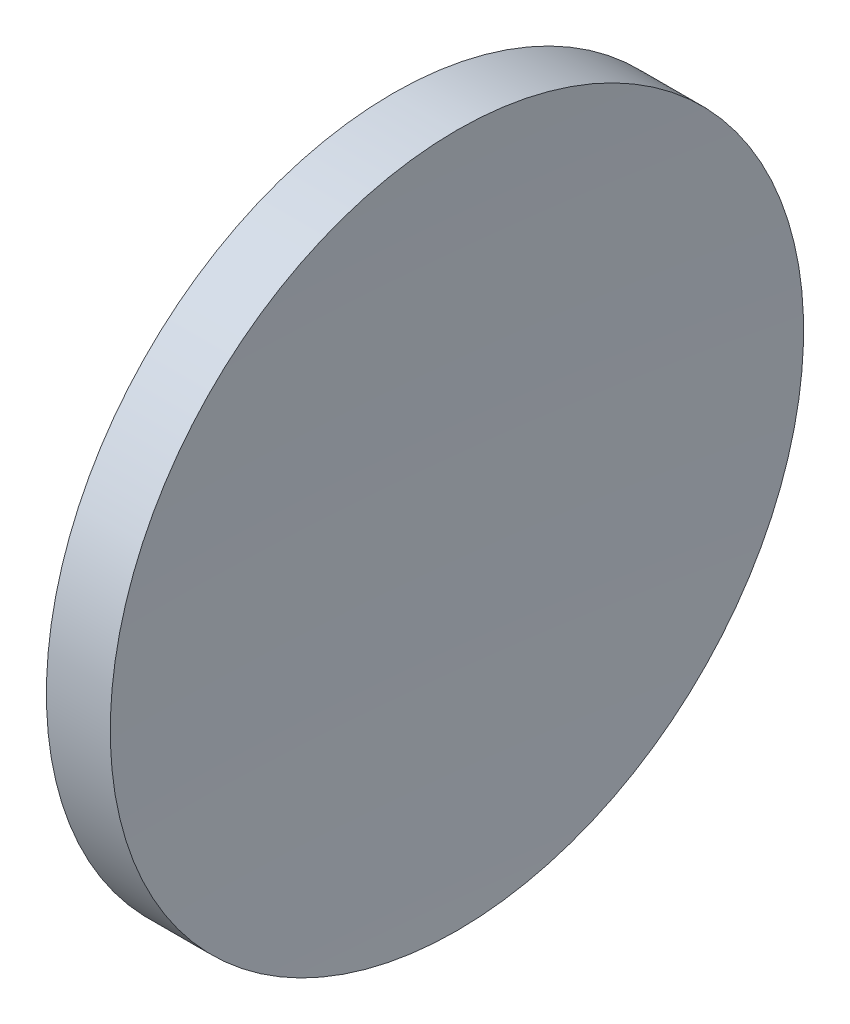
ISO-10303-21;
HEADER;
FILE_DESCRIPTION(('STEP AP214'),'2;1');
FILE_NAME('part.step','',(''),(''),'','','');
FILE_SCHEMA(('AUTOMOTIVE_DESIGN { 1 0 10303 214 1 1 1 1 }'));
ENDSEC;
DATA;
#1=APPLICATION_CONTEXT('core data for automotive mechanical design processes');
#2=APPLICATION_PROTOCOL_DEFINITION('international standard','automotive_design',2000,#1);
#3=PRODUCT_CONTEXT('',#1,'mechanical');
#4=PRODUCT('Part','Part','',(#3));
#5=PRODUCT_RELATED_PRODUCT_CATEGORY('part','',(#4));
#6=PRODUCT_DEFINITION_FORMATION('','',#4);
#7=PRODUCT_DEFINITION_CONTEXT('part definition',#1,'design');
#8=PRODUCT_DEFINITION('design','',#6,#7);
#9=PRODUCT_DEFINITION_SHAPE('','',#8);
#10=(LENGTH_UNIT() NAMED_UNIT(*) SI_UNIT(.MILLI.,.METRE.));
#11=(NAMED_UNIT(*) PLANE_ANGLE_UNIT() SI_UNIT($,.RADIAN.));
#12=(NAMED_UNIT(*) SI_UNIT($,.STERADIAN.) SOLID_ANGLE_UNIT());
#13=UNCERTAINTY_MEASURE_WITH_UNIT(LENGTH_MEASURE(1.E-05),#10,'distance_accuracy_value','');
#14=(GEOMETRIC_REPRESENTATION_CONTEXT(3) GLOBAL_UNCERTAINTY_ASSIGNED_CONTEXT((#13)) GLOBAL_UNIT_ASSIGNED_CONTEXT((#10,
#11,#12)) REPRESENTATION_CONTEXT('',''));
#15=CARTESIAN_POINT('',(0.,0.,0.));
#16=DIRECTION('',(0.,0.,1.));
#17=DIRECTION('',(1.,0.,0.));
#18=AXIS2_PLACEMENT_3D('',#15,#16,#17);
#19=CARTESIAN_POINT('',(317.538190158021,32.5787259132932,0.));
#20=DIRECTION('',(-1.,0.,0.));
#21=DIRECTION('',(0.,-1.,0.));
#22=AXIS2_PLACEMENT_3D('',#19,#20,#21);
#23=SPHERICAL_SURFACE('',#22,258.18);
#24=CARTESIAN_POINT('',(59.6609666581548,32.5787259132931,0.));
#25=DIRECTION('',(-1.,0.,0.));
#26=DIRECTION('',(0.,-1.,0.));
#27=AXIS2_PLACEMENT_3D('',#24,#25,#26);
#28=CIRCLE('',#27,12.5);
#29=CARTESIAN_POINT('',(59.6609666581548,20.0787259132931,0.));
#30=VERTEX_POINT('',#29);
#31=EDGE_CURVE('E10',#30,#30,#28,.T.);
#32=ORIENTED_EDGE('',*,*,#31,.F.);
#33=EDGE_LOOP('',(#32));
#34=FACE_BOUND('',#33,.T.);
#35=ADVANCED_FACE('F35',(#34),#23,.F.);
#36=CARTESIAN_POINT('',(55.0073946244212,32.5787259132931,0.));
#37=DIRECTION('',(-1.,0.,0.));
#38=DIRECTION('',(0.,-1.,0.));
#39=AXIS2_PLACEMENT_3D('',#36,#37,#38);
#40=CYLINDRICAL_SURFACE('',#39,12.5);
#41=CARTESIAN_POINT('',(57.3581901580211,32.5787259132931,0.));
#42=DIRECTION('',(-1.,0.,0.));
#43=DIRECTION('',(0.,-1.,0.));
#44=AXIS2_PLACEMENT_3D('',#41,#42,#43);
#45=CIRCLE('',#44,12.5);
#46=CARTESIAN_POINT('',(57.3581901580211,20.0787259132931,0.));
#47=VERTEX_POINT('',#46);
#48=EDGE_CURVE('E41',#47,#47,#45,.T.);
#49=ORIENTED_EDGE('',*,*,#48,.F.);
#50=EDGE_LOOP('',(#49));
#51=FACE_BOUND('',#50,.T.);
#52=ORIENTED_EDGE('',*,*,#31,.T.);
#53=EDGE_LOOP('',(#52));
#54=FACE_BOUND('',#53,.T.);
#55=ADVANCED_FACE('F49',(#51,#54),#40,.T.);
#56=CARTESIAN_POINT('',(57.3581901580211,32.5787259132931,0.));
#57=DIRECTION('',(1.,0.,0.));
#58=DIRECTION('',(0.,1.,0.));
#59=AXIS2_PLACEMENT_3D('',#56,#57,#58);
#60=PLANE('',#59);
#61=ORIENTED_EDGE('',*,*,#48,.T.);
#62=EDGE_LOOP('',(#61));
#63=FACE_BOUND('',#62,.T.);
#64=ADVANCED_FACE('F47',(#63),#60,.F.);
#65=CLOSED_SHELL('',(#35,#55,#64));
#66=MANIFOLD_SOLID_BREP('B2',#65);
#67=ADVANCED_BREP_SHAPE_REPRESENTATION('',(#18,#66),#14);
#68=SHAPE_DEFINITION_REPRESENTATION(#9,#67);
ENDSEC;
END-ISO-10303-21;
